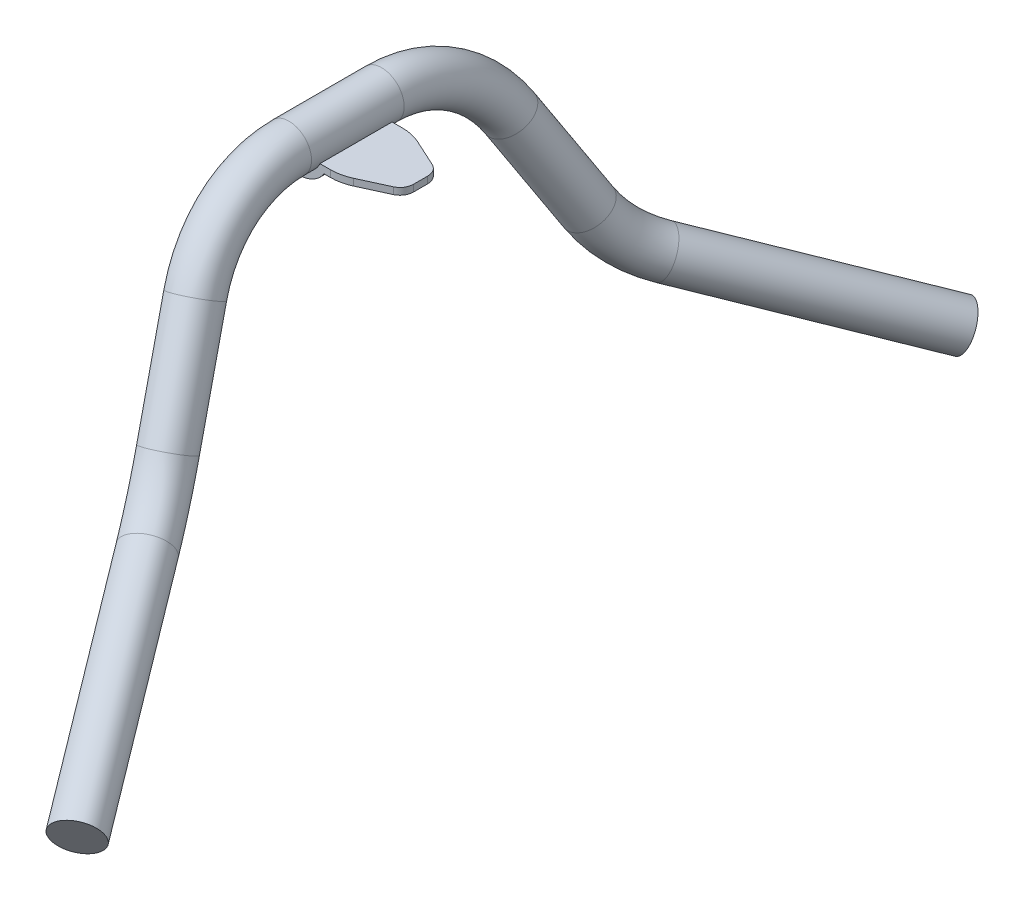
ISO-10303-21;
HEADER;
FILE_DESCRIPTION(('STEP AP214'),'2;1');
FILE_NAME('part.step','',(''),(''),'','','');
FILE_SCHEMA(('AUTOMOTIVE_DESIGN { 1 0 10303 214 1 1 1 1 }'));
ENDSEC;
DATA;
#1=APPLICATION_CONTEXT('core data for automotive mechanical design processes');
#2=APPLICATION_PROTOCOL_DEFINITION('international standard','automotive_design',2000,#1);
#3=PRODUCT_CONTEXT('',#1,'mechanical');
#4=PRODUCT('Part','Part','',(#3));
#5=PRODUCT_RELATED_PRODUCT_CATEGORY('part','',(#4));
#6=PRODUCT_DEFINITION_FORMATION('','',#4);
#7=PRODUCT_DEFINITION_CONTEXT('part definition',#1,'design');
#8=PRODUCT_DEFINITION('design','',#6,#7);
#9=PRODUCT_DEFINITION_SHAPE('','',#8);
#10=(LENGTH_UNIT() NAMED_UNIT(*) SI_UNIT(.MILLI.,.METRE.));
#11=(NAMED_UNIT(*) PLANE_ANGLE_UNIT() SI_UNIT($,.RADIAN.));
#12=(NAMED_UNIT(*) SI_UNIT($,.STERADIAN.) SOLID_ANGLE_UNIT());
#13=UNCERTAINTY_MEASURE_WITH_UNIT(LENGTH_MEASURE(1.E-05),#10,'distance_accuracy_value','');
#14=(GEOMETRIC_REPRESENTATION_CONTEXT(3) GLOBAL_UNCERTAINTY_ASSIGNED_CONTEXT((#13)) GLOBAL_UNIT_ASSIGNED_CONTEXT((#10,
#11,#12)) REPRESENTATION_CONTEXT('',''));
#15=CARTESIAN_POINT('',(0.,0.,0.));
#16=DIRECTION('',(0.,0.,1.));
#17=DIRECTION('',(1.,0.,0.));
#18=AXIS2_PLACEMENT_3D('',#15,#16,#17);
#19=CARTESIAN_POINT('',(-28.448,10.16,13.97));
#20=DIRECTION('',(0.,-1.,0.));
#21=DIRECTION('',(0.,0.,-1.));
#22=AXIS2_PLACEMENT_3D('',#19,#20,#21);
#23=CYLINDRICAL_SURFACE('',#22,6.35);
#24=CARTESIAN_POINT('',(-28.448,6.35,13.97));
#25=DIRECTION('',(0.,-1.,0.));
#26=DIRECTION('',(0.,0.,-1.));
#27=AXIS2_PLACEMENT_3D('',#24,#25,#26);
#28=CIRCLE('',#27,6.35);
#29=CARTESIAN_POINT('',(-28.448,6.35,20.32));
#30=VERTEX_POINT('',#29);
#31=CARTESIAN_POINT('',(-34.798,6.35,13.97));
#32=VERTEX_POINT('',#31);
#33=EDGE_CURVE('E53',#30,#32,#28,.T.);
#34=ORIENTED_EDGE('',*,*,#33,.F.);
#35=DIRECTION('',(0.,-1.,0.));
#36=VECTOR('',#35,1.);
#37=CARTESIAN_POINT('',(-28.448,10.16,20.32));
#38=LINE('',#37,#36);
#39=CARTESIAN_POINT('',(-28.448,10.16,20.32));
#40=VERTEX_POINT('',#39);
#41=EDGE_CURVE('E12',#40,#30,#38,.T.);
#42=ORIENTED_EDGE('',*,*,#41,.F.);
#43=CARTESIAN_POINT('',(-28.448,10.16,13.97));
#44=DIRECTION('',(0.,1.,0.));
#45=DIRECTION('',(0.,0.,1.));
#46=AXIS2_PLACEMENT_3D('',#43,#44,#45);
#47=CIRCLE('',#46,6.35);
#48=CARTESIAN_POINT('',(-34.798,10.16,13.97));
#49=VERTEX_POINT('',#48);
#50=EDGE_CURVE('E265',#49,#40,#47,.T.);
#51=ORIENTED_EDGE('',*,*,#50,.F.);
#52=DIRECTION('',(0.,-1.,0.));
#53=VECTOR('',#52,1.);
#54=CARTESIAN_POINT('',(-34.798,10.16,13.97));
#55=LINE('',#54,#53);
#56=EDGE_CURVE('E187',#49,#32,#55,.T.);
#57=ORIENTED_EDGE('',*,*,#56,.T.);
#58=EDGE_LOOP('',(#34,#42,#51,#57));
#59=FACE_BOUND('',#58,.T.);
#60=ADVANCED_FACE('F39',(#59),#23,.T.);
#61=CARTESIAN_POINT('',(-28.448,10.16,20.32));
#62=DIRECTION('',(0.,0.,-1.));
#63=DIRECTION('',(-1.,0.,0.));
#64=AXIS2_PLACEMENT_3D('',#61,#62,#63);
#65=PLANE('',#64);
#66=CARTESIAN_POINT('',(-12.9982577348122,15.24,20.32));
#67=DIRECTION('',(0.,0.,-1.));
#68=DIRECTION('',(1.,0.,0.));
#69=AXIS2_PLACEMENT_3D('',#66,#67,#68);
#70=CIRCLE('',#69,12.7);
#71=CARTESIAN_POINT('',(-1.35851546962433,10.16,20.32));
#72=VERTEX_POINT('',#71);
#73=CARTESIAN_POINT('',(-24.638,10.16,20.32));
#74=VERTEX_POINT('',#73);
#75=EDGE_CURVE('E159',#72,#74,#70,.T.);
#76=ORIENTED_EDGE('',*,*,#75,.T.);
#77=DIRECTION('',(1.,0.,0.));
#78=VECTOR('',#77,1.);
#79=CARTESIAN_POINT('',(-28.448,10.16,20.32));
#80=LINE('',#79,#78);
#81=EDGE_CURVE('E267',#40,#74,#80,.T.);
#82=ORIENTED_EDGE('',*,*,#81,.F.);
#83=ORIENTED_EDGE('',*,*,#41,.T.);
#84=DIRECTION('',(1.,0.,0.));
#85=VECTOR('',#84,1.);
#86=CARTESIAN_POINT('',(-34.798,6.35,20.32));
#87=LINE('',#86,#85);
#88=CARTESIAN_POINT('',(-26.9104106954434,6.35,20.32));
#89=VERTEX_POINT('',#88);
#90=EDGE_CURVE('E238',#30,#89,#87,.T.);
#91=ORIENTED_EDGE('',*,*,#90,.T.);
#92=CARTESIAN_POINT('',(-12.9982577348122,15.24,20.32));
#93=DIRECTION('',(0.,0.,1.));
#94=DIRECTION('',(1.,0.,0.));
#95=AXIS2_PLACEMENT_3D('',#92,#93,#94);
#96=CIRCLE('',#95,16.51);
#97=CARTESIAN_POINT('',(0.913895225819061,6.35,20.32));
#98=VERTEX_POINT('',#97);
#99=EDGE_CURVE('E233',#89,#98,#96,.T.);
#100=ORIENTED_EDGE('',*,*,#99,.T.);
#101=DIRECTION('',(1.,0.,0.));
#102=VECTOR('',#101,1.);
#103=CARTESIAN_POINT('',(35.052,6.35,20.32));
#104=LINE('',#103,#102);
#105=CARTESIAN_POINT('',(4.60708517540099,6.35,20.32));
#106=VERTEX_POINT('',#105);
#107=EDGE_CURVE('E230',#98,#106,#104,.T.);
#108=ORIENTED_EDGE('',*,*,#107,.T.);
#109=DIRECTION('',(0.,-1.,0.));
#110=VECTOR('',#109,1.);
#111=CARTESIAN_POINT('',(4.6070851754009,10.16,20.32));
#112=LINE('',#111,#110);
#113=CARTESIAN_POINT('',(4.6070851754009,10.16,20.32));
#114=VERTEX_POINT('',#113);
#115=EDGE_CURVE('E46',#114,#106,#112,.T.);
#116=ORIENTED_EDGE('',*,*,#115,.F.);
#117=EDGE_CURVE('E227',#72,#114,#80,.T.);
#118=ORIENTED_EDGE('',*,*,#117,.F.);
#119=EDGE_LOOP('',(#76,#82,#83,#91,#100,#108,#116,#118));
#120=FACE_BOUND('',#119,.T.);
#121=ADVANCED_FACE('F226',(#120),#65,.F.);
#122=CARTESIAN_POINT('',(4.60708517540099,10.16,-5.07999999999999));
#123=DIRECTION('',(0.,-1.,0.));
#124=DIRECTION('',(0.,0.,-1.));
#125=AXIS2_PLACEMENT_3D('',#122,#123,#124);
#126=CYLINDRICAL_SURFACE('',#125,25.4);
#127=CARTESIAN_POINT('',(4.60708517540099,6.35,-5.07999999999999));
#128=DIRECTION('',(0.,-1.,0.));
#129=DIRECTION('',(0.,0.,-1.));
#130=AXIS2_PLACEMENT_3D('',#127,#128,#129);
#131=CIRCLE('',#130,25.4);
#132=CARTESIAN_POINT('',(15.206332962813,6.35,18.0028062925859));
#133=VERTEX_POINT('',#132);
#134=EDGE_CURVE('E222',#133,#106,#131,.T.);
#135=ORIENTED_EDGE('',*,*,#134,.F.);
#136=DIRECTION('',(0.,-1.,0.));
#137=VECTOR('',#136,1.);
#138=CARTESIAN_POINT('',(15.206332962813,10.16,18.0028062925859));
#139=LINE('',#138,#137);
#140=CARTESIAN_POINT('',(15.206332962813,10.16,18.0028062925859));
#141=VERTEX_POINT('',#140);
#142=EDGE_CURVE('E213',#141,#133,#139,.T.);
#143=ORIENTED_EDGE('',*,*,#142,.F.);
#144=CARTESIAN_POINT('',(4.60708517540099,10.16,-5.07999999999999));
#145=DIRECTION('',(0.,1.,0.));
#146=DIRECTION('',(0.,0.,1.));
#147=AXIS2_PLACEMENT_3D('',#144,#145,#146);
#148=CIRCLE('',#147,25.4);
#149=EDGE_CURVE('E223',#114,#141,#148,.T.);
#150=ORIENTED_EDGE('',*,*,#149,.F.);
#151=ORIENTED_EDGE('',*,*,#115,.T.);
#152=EDGE_LOOP('',(#135,#143,#150,#151));
#153=FACE_BOUND('',#152,.T.);
#154=ADVANCED_FACE('F220',(#153),#126,.T.);
#155=CARTESIAN_POINT('',(15.206332962813,10.16,18.0028062925859));
#156=DIRECTION('',(-0.417293219976847,0.,-0.90877190128291));
#157=DIRECTION('',(-0.90877190128291,0.,0.417293219976847));
#158=AXIS2_PLACEMENT_3D('',#155,#156,#157);
#159=PLANE('',#158);
#160=DIRECTION('',(-0.90877190128291,0.,0.417293219976847));
#161=VECTOR('',#160,1.);
#162=CARTESIAN_POINT('',(15.206332962813,6.35,18.0028062925859));
#163=LINE('',#162,#161);
#164=CARTESIAN_POINT('',(30.6117743362235,6.35,10.9288791313259));
#165=VERTEX_POINT('',#164);
#166=EDGE_CURVE('E262',#165,#133,#163,.T.);
#167=ORIENTED_EDGE('',*,*,#166,.F.);
#168=DIRECTION('',(0.,-1.,0.));
#169=VECTOR('',#168,1.);
#170=CARTESIAN_POINT('',(30.6117743362235,10.16,10.9288791313259));
#171=LINE('',#170,#169);
#172=CARTESIAN_POINT('',(30.6117743362235,10.16,10.9288791313259));
#173=VERTEX_POINT('',#172);
#174=EDGE_CURVE('E210',#173,#165,#171,.T.);
#175=ORIENTED_EDGE('',*,*,#174,.F.);
#176=DIRECTION('',(0.90877190128291,0.,-0.417293219976847));
#177=VECTOR('',#176,1.);
#178=CARTESIAN_POINT('',(15.206332962813,10.16,18.0028062925859));
#179=LINE('',#178,#177);
#180=EDGE_CURVE('E271',#141,#173,#179,.T.);
#181=ORIENTED_EDGE('',*,*,#180,.F.);
#182=ORIENTED_EDGE('',*,*,#142,.T.);
#183=EDGE_LOOP('',(#167,#175,#181,#182));
#184=FACE_BOUND('',#183,.T.);
#185=ADVANCED_FACE('F360',(#184),#159,.F.);
#186=CARTESIAN_POINT('',(27.432,10.16,4.00403724355014));
#187=DIRECTION('',(0.,-1.,0.));
#188=DIRECTION('',(0.,0.,-1.));
#189=AXIS2_PLACEMENT_3D('',#186,#187,#188);
#190=CYLINDRICAL_SURFACE('',#189,7.62);
#191=CARTESIAN_POINT('',(27.432,6.35,4.00403724355014));
#192=DIRECTION('',(0.,-1.,0.));
#193=DIRECTION('',(0.,0.,-1.));
#194=AXIS2_PLACEMENT_3D('',#191,#192,#193);
#195=CIRCLE('',#194,7.62);
#196=CARTESIAN_POINT('',(35.052,6.35,4.0040372435501));
#197=VERTEX_POINT('',#196);
#198=EDGE_CURVE('E260',#197,#165,#195,.T.);
#199=ORIENTED_EDGE('',*,*,#198,.F.);
#200=DIRECTION('',(0.,-1.,0.));
#201=VECTOR('',#200,1.);
#202=CARTESIAN_POINT('',(35.052,10.16,4.0040372435501));
#203=LINE('',#202,#201);
#204=CARTESIAN_POINT('',(35.052,10.16,4.0040372435501));
#205=VERTEX_POINT('',#204);
#206=EDGE_CURVE('E207',#205,#197,#203,.T.);
#207=ORIENTED_EDGE('',*,*,#206,.F.);
#208=CARTESIAN_POINT('',(27.432,10.16,4.00403724355014));
#209=DIRECTION('',(0.,1.,0.));
#210=DIRECTION('',(0.,0.,1.));
#211=AXIS2_PLACEMENT_3D('',#208,#209,#210);
#212=CIRCLE('',#211,7.62);
#213=EDGE_CURVE('E273',#173,#205,#212,.T.);
#214=ORIENTED_EDGE('',*,*,#213,.F.);
#215=ORIENTED_EDGE('',*,*,#174,.T.);
#216=EDGE_LOOP('',(#199,#207,#214,#215));
#217=FACE_BOUND('',#216,.T.);
#218=ADVANCED_FACE('F356',(#217),#190,.T.);
#219=CARTESIAN_POINT('',(35.052,10.16,4.0040372435501));
#220=DIRECTION('',(-1.,0.,0.));
#221=DIRECTION('',(0.,0.,1.));
#222=AXIS2_PLACEMENT_3D('',#219,#220,#221);
#223=PLANE('',#222);
#224=DIRECTION('',(0.,0.,1.));
#225=VECTOR('',#224,1.);
#226=CARTESIAN_POINT('',(35.052,6.35,-20.32));
#227=LINE('',#226,#225);
#228=CARTESIAN_POINT('',(35.052,6.35,-4.00403724355014));
#229=VERTEX_POINT('',#228);
#230=EDGE_CURVE('E164',#229,#197,#227,.T.);
#231=ORIENTED_EDGE('',*,*,#230,.F.);
#232=DIRECTION('',(0.,-1.,0.));
#233=VECTOR('',#232,1.);
#234=CARTESIAN_POINT('',(35.052,10.16,-4.0040372435501));
#235=LINE('',#234,#233);
#236=CARTESIAN_POINT('',(35.052,10.16,-4.0040372435501));
#237=VERTEX_POINT('',#236);
#238=EDGE_CURVE('E204',#237,#229,#235,.T.);
#239=ORIENTED_EDGE('',*,*,#238,.F.);
#240=DIRECTION('',(0.,0.,-1.));
#241=VECTOR('',#240,1.);
#242=CARTESIAN_POINT('',(35.052,10.16,4.0040372435501));
#243=LINE('',#242,#241);
#244=EDGE_CURVE('E275',#205,#237,#243,.T.);
#245=ORIENTED_EDGE('',*,*,#244,.F.);
#246=ORIENTED_EDGE('',*,*,#206,.T.);
#247=EDGE_LOOP('',(#231,#239,#245,#246));
#248=FACE_BOUND('',#247,.T.);
#249=ADVANCED_FACE('F352',(#248),#223,.F.);
#250=CARTESIAN_POINT('',(27.432,10.16,-4.00403724355014));
#251=DIRECTION('',(0.,-1.,0.));
#252=DIRECTION('',(0.,0.,-1.));
#253=AXIS2_PLACEMENT_3D('',#250,#251,#252);
#254=CYLINDRICAL_SURFACE('',#253,7.62);
#255=CARTESIAN_POINT('',(27.432,6.35,-4.00403724355014));
#256=DIRECTION('',(0.,-1.,0.));
#257=DIRECTION('',(0.,0.,-1.));
#258=AXIS2_PLACEMENT_3D('',#255,#256,#257);
#259=CIRCLE('',#258,7.62);
#260=CARTESIAN_POINT('',(30.6117743362235,6.35,-10.9288791313259));
#261=VERTEX_POINT('',#260);
#262=EDGE_CURVE('E258',#261,#229,#259,.T.);
#263=ORIENTED_EDGE('',*,*,#262,.F.);
#264=DIRECTION('',(0.,-1.,0.));
#265=VECTOR('',#264,1.);
#266=CARTESIAN_POINT('',(30.6117743362235,10.16,-10.9288791313259));
#267=LINE('',#266,#265);
#268=CARTESIAN_POINT('',(30.6117743362235,10.16,-10.9288791313259));
#269=VERTEX_POINT('',#268);
#270=EDGE_CURVE('E201',#269,#261,#267,.T.);
#271=ORIENTED_EDGE('',*,*,#270,.F.);
#272=CARTESIAN_POINT('',(27.432,10.16,-4.00403724355014));
#273=DIRECTION('',(0.,1.,0.));
#274=DIRECTION('',(0.,0.,1.));
#275=AXIS2_PLACEMENT_3D('',#272,#273,#274);
#276=CIRCLE('',#275,7.62);
#277=EDGE_CURVE('E277',#237,#269,#276,.T.);
#278=ORIENTED_EDGE('',*,*,#277,.F.);
#279=ORIENTED_EDGE('',*,*,#238,.T.);
#280=EDGE_LOOP('',(#263,#271,#278,#279));
#281=FACE_BOUND('',#280,.T.);
#282=ADVANCED_FACE('F349',(#281),#254,.T.);
#283=CARTESIAN_POINT('',(30.6117743362235,10.16,-10.9288791313259));
#284=DIRECTION('',(-0.417293219976847,0.,0.90877190128291));
#285=DIRECTION('',(0.90877190128291,0.,0.417293219976847));
#286=AXIS2_PLACEMENT_3D('',#283,#284,#285);
#287=PLANE('',#286);
#288=DIRECTION('',(0.90877190128291,0.,0.417293219976847));
#289=VECTOR('',#288,1.);
#290=CARTESIAN_POINT('',(30.6117743362235,6.35,-10.9288791313259));
#291=LINE('',#290,#289);
#292=CARTESIAN_POINT('',(15.206332962813,6.35,-18.0028062925859));
#293=VERTEX_POINT('',#292);
#294=EDGE_CURVE('E256',#293,#261,#291,.T.);
#295=ORIENTED_EDGE('',*,*,#294,.F.);
#296=DIRECTION('',(0.,-1.,0.));
#297=VECTOR('',#296,1.);
#298=CARTESIAN_POINT('',(15.206332962813,10.16,-18.0028062925859));
#299=LINE('',#298,#297);
#300=CARTESIAN_POINT('',(15.206332962813,10.16,-18.0028062925859));
#301=VERTEX_POINT('',#300);
#302=EDGE_CURVE('E198',#301,#293,#299,.T.);
#303=ORIENTED_EDGE('',*,*,#302,.F.);
#304=DIRECTION('',(-0.90877190128291,0.,-0.417293219976847));
#305=VECTOR('',#304,1.);
#306=CARTESIAN_POINT('',(30.6117743362235,10.16,-10.9288791313259));
#307=LINE('',#306,#305);
#308=EDGE_CURVE('E278',#269,#301,#307,.T.);
#309=ORIENTED_EDGE('',*,*,#308,.F.);
#310=ORIENTED_EDGE('',*,*,#270,.T.);
#311=EDGE_LOOP('',(#295,#303,#309,#310));
#312=FACE_BOUND('',#311,.T.);
#313=ADVANCED_FACE('F285',(#312),#287,.F.);
#314=CARTESIAN_POINT('',(4.60708517540099,10.16,5.07999999999999));
#315=DIRECTION('',(0.,-1.,0.));
#316=DIRECTION('',(0.,0.,-1.));
#317=AXIS2_PLACEMENT_3D('',#314,#315,#316);
#318=CYLINDRICAL_SURFACE('',#317,25.4);
#319=CARTESIAN_POINT('',(4.60708517540099,6.35,5.07999999999999));
#320=DIRECTION('',(0.,-1.,0.));
#321=DIRECTION('',(0.,0.,-1.));
#322=AXIS2_PLACEMENT_3D('',#319,#320,#321);
#323=CIRCLE('',#322,25.4);
#324=CARTESIAN_POINT('',(4.6070851754009,6.35,-20.32));
#325=VERTEX_POINT('',#324);
#326=EDGE_CURVE('E254',#325,#293,#323,.T.);
#327=ORIENTED_EDGE('',*,*,#326,.F.);
#328=DIRECTION('',(0.,-1.,0.));
#329=VECTOR('',#328,1.);
#330=CARTESIAN_POINT('',(4.6070851754009,10.16,-20.32));
#331=LINE('',#330,#329);
#332=CARTESIAN_POINT('',(4.6070851754009,10.16,-20.32));
#333=VERTEX_POINT('',#332);
#334=EDGE_CURVE('E196',#333,#325,#331,.T.);
#335=ORIENTED_EDGE('',*,*,#334,.F.);
#336=CARTESIAN_POINT('',(4.60708517540099,10.16,5.07999999999999));
#337=DIRECTION('',(0.,1.,0.));
#338=DIRECTION('',(0.,0.,-1.));
#339=AXIS2_PLACEMENT_3D('',#336,#337,#338);
#340=CIRCLE('',#339,25.4);
#341=EDGE_CURVE('E178',#301,#333,#340,.T.);
#342=ORIENTED_EDGE('',*,*,#341,.F.);
#343=ORIENTED_EDGE('',*,*,#302,.T.);
#344=EDGE_LOOP('',(#327,#335,#342,#343));
#345=FACE_BOUND('',#344,.T.);
#346=ADVANCED_FACE('F288',(#345),#318,.T.);
#347=CARTESIAN_POINT('',(4.6070851754009,10.16,-20.32));
#348=DIRECTION('',(0.,0.,1.));
#349=DIRECTION('',(1.,0.,0.));
#350=AXIS2_PLACEMENT_3D('',#347,#348,#349);
#351=PLANE('',#350);
#352=CARTESIAN_POINT('',(-12.9982577348122,15.24,-20.32));
#353=DIRECTION('',(0.,0.,-1.));
#354=DIRECTION('',(1.,0.,0.));
#355=AXIS2_PLACEMENT_3D('',#352,#353,#354);
#356=CIRCLE('',#355,12.7);
#357=CARTESIAN_POINT('',(-1.35851546962433,10.16,-20.32));
#358=VERTEX_POINT('',#357);
#359=CARTESIAN_POINT('',(-24.638,10.16,-20.32));
#360=VERTEX_POINT('',#359);
#361=EDGE_CURVE('E156',#358,#360,#356,.T.);
#362=ORIENTED_EDGE('',*,*,#361,.F.);
#363=DIRECTION('',(-1.,0.,0.));
#364=VECTOR('',#363,1.);
#365=CARTESIAN_POINT('',(4.6070851754009,10.16,-20.32));
#366=LINE('',#365,#364);
#367=EDGE_CURVE('E170',#333,#358,#366,.T.);
#368=ORIENTED_EDGE('',*,*,#367,.F.);
#369=ORIENTED_EDGE('',*,*,#334,.T.);
#370=DIRECTION('',(1.,0.,0.));
#371=VECTOR('',#370,1.);
#372=CARTESIAN_POINT('',(35.052,6.35,-20.32));
#373=LINE('',#372,#371);
#374=CARTESIAN_POINT('',(0.913895225819061,6.35,-20.32));
#375=VERTEX_POINT('',#374);
#376=EDGE_CURVE('E251',#375,#325,#373,.T.);
#377=ORIENTED_EDGE('',*,*,#376,.F.);
#378=CARTESIAN_POINT('',(-12.9982577348122,15.24,-20.32));
#379=DIRECTION('',(0.,0.,1.));
#380=DIRECTION('',(1.,0.,0.));
#381=AXIS2_PLACEMENT_3D('',#378,#379,#380);
#382=CIRCLE('',#381,16.51);
#383=CARTESIAN_POINT('',(-26.9104106954434,6.35,-20.32));
#384=VERTEX_POINT('',#383);
#385=EDGE_CURVE('E293',#384,#375,#382,.T.);
#386=ORIENTED_EDGE('',*,*,#385,.F.);
#387=DIRECTION('',(1.,0.,0.));
#388=VECTOR('',#387,1.);
#389=CARTESIAN_POINT('',(-34.798,6.35,-20.32));
#390=LINE('',#389,#388);
#391=CARTESIAN_POINT('',(-28.448,6.35,-20.32));
#392=VERTEX_POINT('',#391);
#393=EDGE_CURVE('E236',#392,#384,#390,.T.);
#394=ORIENTED_EDGE('',*,*,#393,.F.);
#395=DIRECTION('',(0.,-1.,0.));
#396=VECTOR('',#395,1.);
#397=CARTESIAN_POINT('',(-28.448,10.16,-20.32));
#398=LINE('',#397,#396);
#399=CARTESIAN_POINT('',(-28.448,10.16,-20.32));
#400=VERTEX_POINT('',#399);
#401=EDGE_CURVE('E193',#400,#392,#398,.T.);
#402=ORIENTED_EDGE('',*,*,#401,.F.);
#403=EDGE_CURVE('E172',#360,#400,#366,.T.);
#404=ORIENTED_EDGE('',*,*,#403,.F.);
#405=EDGE_LOOP('',(#362,#368,#369,#377,#386,#394,#402,#404));
#406=FACE_BOUND('',#405,.T.);
#407=ADVANCED_FACE('F168',(#406),#351,.F.);
#408=CARTESIAN_POINT('',(-28.448,10.16,-13.97));
#409=DIRECTION('',(0.,-1.,0.));
#410=DIRECTION('',(0.,0.,-1.));
#411=AXIS2_PLACEMENT_3D('',#408,#409,#410);
#412=CYLINDRICAL_SURFACE('',#411,6.35);
#413=CARTESIAN_POINT('',(-28.448,6.35,-13.97));
#414=DIRECTION('',(0.,-1.,0.));
#415=DIRECTION('',(0.,0.,-1.));
#416=AXIS2_PLACEMENT_3D('',#413,#414,#415);
#417=CIRCLE('',#416,6.35);
#418=CARTESIAN_POINT('',(-34.798,6.35,-13.97));
#419=VERTEX_POINT('',#418);
#420=EDGE_CURVE('E242',#419,#392,#417,.T.);
#421=ORIENTED_EDGE('',*,*,#420,.F.);
#422=DIRECTION('',(0.,-1.,0.));
#423=VECTOR('',#422,1.);
#424=CARTESIAN_POINT('',(-34.798,10.16,-13.97));
#425=LINE('',#424,#423);
#426=CARTESIAN_POINT('',(-34.798,10.16,-13.97));
#427=VERTEX_POINT('',#426);
#428=EDGE_CURVE('E190',#427,#419,#425,.T.);
#429=ORIENTED_EDGE('',*,*,#428,.F.);
#430=CARTESIAN_POINT('',(-28.448,10.16,-13.97));
#431=DIRECTION('',(0.,1.,0.));
#432=DIRECTION('',(0.,0.,1.));
#433=AXIS2_PLACEMENT_3D('',#430,#431,#432);
#434=CIRCLE('',#433,6.35);
#435=EDGE_CURVE('E180',#400,#427,#434,.T.);
#436=ORIENTED_EDGE('',*,*,#435,.F.);
#437=ORIENTED_EDGE('',*,*,#401,.T.);
#438=EDGE_LOOP('',(#421,#429,#436,#437));
#439=FACE_BOUND('',#438,.T.);
#440=ADVANCED_FACE('F336',(#439),#412,.T.);
#441=CARTESIAN_POINT('',(-34.798,10.16,-13.97));
#442=DIRECTION('',(1.,0.,0.));
#443=DIRECTION('',(0.,0.,-1.));
#444=AXIS2_PLACEMENT_3D('',#441,#442,#443);
#445=PLANE('',#444);
#446=DIRECTION('',(0.,0.,1.));
#447=VECTOR('',#446,1.);
#448=CARTESIAN_POINT('',(-34.798,6.35,-20.32));
#449=LINE('',#448,#447);
#450=EDGE_CURVE('E249',#419,#32,#449,.T.);
#451=ORIENTED_EDGE('',*,*,#450,.T.);
#452=ORIENTED_EDGE('',*,*,#56,.F.);
#453=DIRECTION('',(0.,0.,1.));
#454=VECTOR('',#453,1.);
#455=CARTESIAN_POINT('',(-34.798,10.16,-13.97));
#456=LINE('',#455,#454);
#457=EDGE_CURVE('E61',#427,#49,#456,.T.);
#458=ORIENTED_EDGE('',*,*,#457,.F.);
#459=ORIENTED_EDGE('',*,*,#428,.T.);
#460=EDGE_LOOP('',(#451,#452,#458,#459));
#461=FACE_BOUND('',#460,.T.);
#462=ADVANCED_FACE('F332',(#461),#445,.F.);
#463=CARTESIAN_POINT('',(-28.448,10.16,13.97));
#464=DIRECTION('',(0.,1.,0.));
#465=DIRECTION('',(0.,0.,1.));
#466=AXIS2_PLACEMENT_3D('',#463,#464,#465);
#467=PLANE('',#466);
#468=ORIENTED_EDGE('',*,*,#81,.T.);
#469=DIRECTION('',(0.,0.,1.));
#470=VECTOR('',#469,1.);
#471=CARTESIAN_POINT('',(-24.638,10.16,-20.32));
#472=LINE('',#471,#470);
#473=EDGE_CURVE('E163',#360,#74,#472,.T.);
#474=ORIENTED_EDGE('',*,*,#473,.F.);
#475=ORIENTED_EDGE('',*,*,#403,.T.);
#476=ORIENTED_EDGE('',*,*,#435,.T.);
#477=ORIENTED_EDGE('',*,*,#457,.T.);
#478=ORIENTED_EDGE('',*,*,#50,.T.);
#479=EDGE_LOOP('',(#468,#474,#475,#476,#477,#478));
#480=FACE_BOUND('',#479,.T.);
#481=ADVANCED_FACE('F320',(#480),#467,.T.);
#482=ORIENTED_EDGE('',*,*,#367,.T.);
#483=DIRECTION('',(0.,0.,1.));
#484=VECTOR('',#483,1.);
#485=CARTESIAN_POINT('',(-1.35851546962433,10.16,-20.32));
#486=LINE('',#485,#484);
#487=EDGE_CURVE('E152',#358,#72,#486,.T.);
#488=ORIENTED_EDGE('',*,*,#487,.T.);
#489=ORIENTED_EDGE('',*,*,#117,.T.);
#490=ORIENTED_EDGE('',*,*,#149,.T.);
#491=ORIENTED_EDGE('',*,*,#180,.T.);
#492=ORIENTED_EDGE('',*,*,#213,.T.);
#493=ORIENTED_EDGE('',*,*,#244,.T.);
#494=ORIENTED_EDGE('',*,*,#277,.T.);
#495=ORIENTED_EDGE('',*,*,#308,.T.);
#496=ORIENTED_EDGE('',*,*,#341,.T.);
#497=EDGE_LOOP('',(#482,#488,#489,#490,#491,#492,#493,#494,#495,#496));
#498=FACE_BOUND('',#497,.T.);
#499=ADVANCED_FACE('F176',(#498),#467,.T.);
#500=CARTESIAN_POINT('',(35.052,6.35,-20.32));
#501=DIRECTION('',(0.,-1.,0.));
#502=DIRECTION('',(0.,0.,-1.));
#503=AXIS2_PLACEMENT_3D('',#500,#501,#502);
#504=PLANE('',#503);
#505=ORIENTED_EDGE('',*,*,#134,.T.);
#506=ORIENTED_EDGE('',*,*,#107,.F.);
#507=DIRECTION('',(0.,0.,1.));
#508=VECTOR('',#507,1.);
#509=CARTESIAN_POINT('',(0.913895225819061,6.35,-20.32));
#510=LINE('',#509,#508);
#511=EDGE_CURVE('E245',#375,#98,#510,.T.);
#512=ORIENTED_EDGE('',*,*,#511,.F.);
#513=ORIENTED_EDGE('',*,*,#376,.T.);
#514=ORIENTED_EDGE('',*,*,#326,.T.);
#515=ORIENTED_EDGE('',*,*,#294,.T.);
#516=ORIENTED_EDGE('',*,*,#262,.T.);
#517=ORIENTED_EDGE('',*,*,#230,.T.);
#518=ORIENTED_EDGE('',*,*,#198,.T.);
#519=ORIENTED_EDGE('',*,*,#166,.T.);
#520=EDGE_LOOP('',(#505,#506,#512,#513,#514,#515,#516,#517,#518,#519));
#521=FACE_BOUND('',#520,.T.);
#522=ADVANCED_FACE('F312',(#521),#504,.T.);
#523=CARTESIAN_POINT('',(-34.798,6.35,-20.32));
#524=DIRECTION('',(0.,-1.,0.));
#525=DIRECTION('',(0.,0.,-1.));
#526=AXIS2_PLACEMENT_3D('',#523,#524,#525);
#527=PLANE('',#526);
#528=ORIENTED_EDGE('',*,*,#33,.T.);
#529=ORIENTED_EDGE('',*,*,#450,.F.);
#530=ORIENTED_EDGE('',*,*,#420,.T.);
#531=ORIENTED_EDGE('',*,*,#393,.T.);
#532=DIRECTION('',(0.,0.,1.));
#533=VECTOR('',#532,1.);
#534=CARTESIAN_POINT('',(-26.9104106954434,6.35,-20.32));
#535=LINE('',#534,#533);
#536=EDGE_CURVE('E247',#384,#89,#535,.T.);
#537=ORIENTED_EDGE('',*,*,#536,.T.);
#538=ORIENTED_EDGE('',*,*,#90,.F.);
#539=EDGE_LOOP('',(#528,#529,#530,#531,#537,#538));
#540=FACE_BOUND('',#539,.T.);
#541=ADVANCED_FACE('F308',(#540),#527,.T.);
#542=CARTESIAN_POINT('',(-12.9982577348122,15.24,-20.32));
#543=DIRECTION('',(0.,0.,1.));
#544=DIRECTION('',(1.,0.,0.));
#545=AXIS2_PLACEMENT_3D('',#542,#543,#544);
#546=CYLINDRICAL_SURFACE('',#545,16.51);
#547=ORIENTED_EDGE('',*,*,#99,.F.);
#548=ORIENTED_EDGE('',*,*,#536,.F.);
#549=ORIENTED_EDGE('',*,*,#385,.T.);
#550=ORIENTED_EDGE('',*,*,#511,.T.);
#551=EDGE_LOOP('',(#547,#548,#549,#550));
#552=FACE_BOUND('',#551,.T.);
#553=ADVANCED_FACE('F311',(#552),#546,.T.);
#554=CARTESIAN_POINT('',(91.1417422651878,-157.48,249.564780828328));
#555=DIRECTION('',(0.479674796747967,-0.414634146341463,0.773298528417378));
#556=DIRECTION('',(0.875032293842701,0.291373953989815,-0.386548449316154));
#557=AXIS2_PLACEMENT_3D('',#554,#555,#556);
#558=PLANE('',#557);
#559=CARTESIAN_POINT('',(91.1417422651878,-157.48,249.564780828328));
#560=DIRECTION('',(0.479674796747967,-0.414634146341463,0.773298528417378));
#561=DIRECTION('',(0.875032293842701,0.291373953989815,-0.386548449316154));
#562=AXIS2_PLACEMENT_3D('',#559,#560,#561);
#563=CIRCLE('',#562,12.7);
#564=CARTESIAN_POINT('',(102.25465239699,-153.779550784329,244.655615522013));
#565=VERTEX_POINT('',#564);
#566=EDGE_CURVE('E297',#565,#565,#563,.T.);
#567=ORIENTED_EDGE('',*,*,#566,.T.);
#568=EDGE_LOOP('',(#567));
#569=FACE_BOUND('',#568,.T.);
#570=ADVANCED_FACE('F439',(#569),#558,.T.);
#571=CARTESIAN_POINT('',(-12.9982577348122,15.24,0.));
#572=DIRECTION('',(0.,0.,1.));
#573=DIRECTION('',(1.,0.,0.));
#574=AXIS2_PLACEMENT_3D('',#571,#572,#573);
#575=CYLINDRICAL_SURFACE('',#574,12.7);
#576=CARTESIAN_POINT('',(-12.9982577348122,15.24,26.0905816371625));
#577=DIRECTION('',(0.,0.,1.));
#578=DIRECTION('',(1.,0.,0.));
#579=AXIS2_PLACEMENT_3D('',#576,#577,#578);
#580=CIRCLE('',#579,12.7);
#581=CARTESIAN_POINT('',(-16.3154348352092,27.4991327623369,26.0905816371625));
#582=VERTEX_POINT('',#581);
#583=EDGE_CURVE('E173',#582,#582,#580,.T.);
#584=ORIENTED_EDGE('',*,*,#583,.F.);
#585=EDGE_LOOP('',(#584));
#586=FACE_BOUND('',#585,.T.);
#587=ORIENTED_EDGE('',*,*,#487,.F.);
#588=ORIENTED_EDGE('',*,*,#361,.T.);
#589=ORIENTED_EDGE('',*,*,#473,.T.);
#590=ORIENTED_EDGE('',*,*,#75,.F.);
#591=EDGE_LOOP('',(#587,#588,#589,#590));
#592=FACE_BOUND('',#591,.T.);
#593=CARTESIAN_POINT('',(-12.9982577348122,15.24,-26.0905816371625));
#594=DIRECTION('',(0.,0.,1.));
#595=DIRECTION('',(1.,0.,0.));
#596=AXIS2_PLACEMENT_3D('',#593,#594,#595);
#597=CIRCLE('',#596,12.7);
#598=CARTESIAN_POINT('',(-16.3154348352092,27.4991327623369,-26.0905816371625));
#599=VERTEX_POINT('',#598);
#600=EDGE_CURVE('E617',#599,#599,#597,.T.);
#601=ORIENTED_EDGE('',*,*,#600,.T.);
#602=EDGE_LOOP('',(#601));
#603=FACE_BOUND('',#602,.T.);
#604=ADVANCED_FACE('F154',(#586,#592,#603),#575,.T.);
#605=CARTESIAN_POINT('',(5.57793402741127,-53.4111434690865,26.0905816371625));
#606=DIRECTION('',(0.965286044278495,0.261195047275358,0.));
#607=DIRECTION('',(-0.261195047275358,0.965286044278495,0.));
#608=AXIS2_PLACEMENT_3D('',#605,#606,#607);
#609=TOROIDAL_SURFACE('',#608,71.12,12.7);
#610=CARTESIAN_POINT('',(-3.22569151135953,-20.8760056084119,88.7165776911974));
#611=DIRECTION('',(0.23,-0.85,0.473919824442912));
#612=DIRECTION('',(0.964109309663438,0.132639507765554,-0.23));
#613=AXIS2_PLACEMENT_3D('',#610,#611,#612);
#614=CIRCLE('',#613,12.7);
#615=CARTESIAN_POINT('',(-4.79776750042574,-15.0661595618628,99.8997912722751));
#616=VERTEX_POINT('',#615);
#617=EDGE_CURVE('E600',#616,#616,#614,.T.);
#618=CARTESIAN_POINT('',(5.57793402741127,-53.4111434690865,26.0905816371625));
#619=DIRECTION('',(0.965286044278495,0.261195047275358,0.));
#620=DIRECTION('',(-0.261195047275358,0.965286044278495,0.));
#621=AXIS2_PLACEMENT_3D('',#618,#619,#620);
#622=CIRCLE('',#621,83.82);
#623=EDGE_CURVE('',#582,#616,#622,.T.);
#624=ORIENTED_EDGE('',*,*,#583,.T.);
#625=ORIENTED_EDGE('',*,*,#617,.F.);
#626=ORIENTED_EDGE('',*,*,#623,.T.);
#627=ORIENTED_EDGE('',*,*,#623,.F.);
#628=EDGE_LOOP('',(#624,#626,#625,#627));
#629=FACE_BOUND('',#628,.T.);
#630=ADVANCED_FACE('F463',(#629),#609,.T.);
#631=CARTESIAN_POINT('',(-3.22569151135953,-20.8760056084119,88.7165776911974));
#632=DIRECTION('',(0.23,-0.85,0.473919824442911));
#633=DIRECTION('',(0.,-0.486975326738723,-0.87341572641424));
#634=AXIS2_PLACEMENT_3D('',#631,#632,#633);
#635=CYLINDRICAL_SURFACE('',#634,12.7);
#636=CARTESIAN_POINT('',(11.2140519105981,-74.240274776516,118.469971897871));
#637=DIRECTION('',(0.23,-0.85,0.473919824442911));
#638=DIRECTION('',(0.964109309663438,0.132639507765554,-0.23));
#639=AXIS2_PLACEMENT_3D('',#636,#637,#638);
#640=CIRCLE('',#639,12.7);
#641=CARTESIAN_POINT('',(4.64803462249985,-80.8352978277174,109.828034156454));
#642=VERTEX_POINT('',#641);
#643=EDGE_CURVE('E304',#642,#642,#640,.T.);
#644=ORIENTED_EDGE('',*,*,#643,.F.);
#645=EDGE_LOOP('',(#644));
#646=FACE_BOUND('',#645,.T.);
#647=ORIENTED_EDGE('',*,*,#617,.T.);
#648=EDGE_LOOP('',(#647));
#649=FACE_BOUND('',#648,.T.);
#650=ADVANCED_FACE('F469',(#646,#649),#635,.T.);
#651=CARTESIAN_POINT('',(47.9837487239481,-37.3081456897879,166.864823249802));
#652=DIRECTION('',(-0.824500728096557,0.0885133921211703,0.558895275327544));
#653=DIRECTION('',(0.561097590753353,0.,0.8277496563882));
#654=AXIS2_PLACEMENT_3D('',#651,#652,#653);
#655=TOROIDAL_SURFACE('',#654,71.12,12.7);
#656=CARTESIAN_POINT('',(26.6346383740884,-101.719622060236,145.570889863772));
#657=DIRECTION('',(0.479674796747967,-0.414634146341463,0.773298528417378));
#658=DIRECTION('',(0.875032293842701,0.291373953989815,-0.386548449316153));
#659=AXIS2_PLACEMENT_3D('',#656,#657,#658);
#660=CIRCLE('',#659,12.7);
#661=CARTESIAN_POINT('',(22.8222972401849,-113.221671412102,141.768401759123));
#662=VERTEX_POINT('',#661);
#663=EDGE_CURVE('E299',#662,#662,#660,.T.);
#664=CARTESIAN_POINT('',(47.9837487239481,-37.3081456897879,166.864823249802));
#665=DIRECTION('',(-0.824500728096557,0.0885133921211703,0.558895275327544));
#666=DIRECTION('',(0.561097590753353,0.,0.8277496563882));
#667=AXIS2_PLACEMENT_3D('',#664,#665,#666);
#668=CIRCLE('',#667,83.82);
#669=EDGE_CURVE('',#642,#662,#668,.T.);
#670=ORIENTED_EDGE('',*,*,#643,.T.);
#671=ORIENTED_EDGE('',*,*,#663,.F.);
#672=ORIENTED_EDGE('',*,*,#669,.T.);
#673=ORIENTED_EDGE('',*,*,#669,.F.);
#674=EDGE_LOOP('',(#670,#672,#671,#673));
#675=FACE_BOUND('',#674,.T.);
#676=ADVANCED_FACE('F544',(#675),#655,.T.);
#677=CARTESIAN_POINT('',(26.6346383740884,-101.719622060236,145.570889863772));
#678=DIRECTION('',(0.479674796747967,-0.414634146341463,0.773298528417378));
#679=DIRECTION('',(0.849789621625089,0.,-0.527121996295249));
#680=AXIS2_PLACEMENT_3D('',#677,#678,#679);
#681=CYLINDRICAL_SURFACE('',#680,12.7);
#682=ORIENTED_EDGE('',*,*,#566,.F.);
#683=EDGE_LOOP('',(#682));
#684=FACE_BOUND('',#683,.T.);
#685=ORIENTED_EDGE('',*,*,#663,.T.);
#686=EDGE_LOOP('',(#685));
#687=FACE_BOUND('',#686,.T.);
#688=ADVANCED_FACE('F440',(#684,#687),#681,.T.);
#689=CARTESIAN_POINT('',(91.1417422651878,-157.48,-249.564780828328));
#690=DIRECTION('',(0.479674796747967,-0.414634146341463,-0.773298528417378));
#691=DIRECTION('',(0.875032293842701,0.291373953989815,0.386548449316154));
#692=AXIS2_PLACEMENT_3D('',#689,#690,#691);
#693=PLANE('',#692);
#694=CARTESIAN_POINT('',(91.1417422651878,-157.48,-249.564780828328));
#695=DIRECTION('',(-0.479674796747967,0.414634146341463,0.773298528417378));
#696=DIRECTION('',(0.875032293842701,0.291373953989815,0.386548449316154));
#697=AXIS2_PLACEMENT_3D('',#694,#695,#696);
#698=CIRCLE('',#697,12.7);
#699=CARTESIAN_POINT('',(102.25465239699,-153.779550784329,-244.655615522013));
#700=VERTEX_POINT('',#699);
#701=EDGE_CURVE('E174',#700,#700,#698,.T.);
#702=ORIENTED_EDGE('',*,*,#701,.F.);
#703=EDGE_LOOP('',(#702));
#704=FACE_BOUND('',#703,.T.);
#705=ADVANCED_FACE('F458',(#704),#693,.T.);
#706=CARTESIAN_POINT('',(5.57793402741127,-53.4111434690865,-26.0905816371625));
#707=DIRECTION('',(0.965286044278495,0.261195047275358,0.));
#708=DIRECTION('',(-0.261195047275358,0.965286044278495,0.));
#709=AXIS2_PLACEMENT_3D('',#706,#707,#708);
#710=TOROIDAL_SURFACE('',#709,71.12,12.7);
#711=CARTESIAN_POINT('',(-3.22569151135953,-20.8760056084119,-88.7165776911974));
#712=DIRECTION('',(-0.23,0.85,0.473919824442912));
#713=DIRECTION('',(0.964109309663438,0.132639507765554,0.23));
#714=AXIS2_PLACEMENT_3D('',#711,#712,#713);
#715=CIRCLE('',#714,12.7);
#716=CARTESIAN_POINT('',(-4.79776750042574,-15.0661595618628,-99.8997912722751));
#717=VERTEX_POINT('',#716);
#718=EDGE_CURVE('E614',#717,#717,#715,.T.);
#719=CARTESIAN_POINT('',(5.57793402741127,-53.4111434690865,-26.0905816371625));
#720=DIRECTION('',(0.965286044278495,0.261195047275358,0.));
#721=DIRECTION('',(-0.261195047275358,0.965286044278495,0.));
#722=AXIS2_PLACEMENT_3D('',#719,#720,#721);
#723=CIRCLE('',#722,83.82);
#724=EDGE_CURVE('',#717,#599,#723,.T.);
#725=ORIENTED_EDGE('',*,*,#718,.T.);
#726=ORIENTED_EDGE('',*,*,#600,.F.);
#727=ORIENTED_EDGE('',*,*,#724,.T.);
#728=ORIENTED_EDGE('',*,*,#724,.F.);
#729=EDGE_LOOP('',(#725,#727,#726,#728));
#730=FACE_BOUND('',#729,.T.);
#731=ADVANCED_FACE('F497',(#730),#710,.T.);
#732=CARTESIAN_POINT('',(-3.22569151135953,-20.8760056084119,-88.7165776911974));
#733=DIRECTION('',(0.23,-0.85,-0.473919824442911));
#734=DIRECTION('',(0.,-0.486975326738723,0.87341572641424));
#735=AXIS2_PLACEMENT_3D('',#732,#733,#734);
#736=CYLINDRICAL_SURFACE('',#735,12.7);
#737=CARTESIAN_POINT('',(11.2140519105981,-74.240274776516,-118.469971897871));
#738=DIRECTION('',(-0.23,0.85,0.473919824442911));
#739=DIRECTION('',(0.964109309663438,0.132639507765554,0.23));
#740=AXIS2_PLACEMENT_3D('',#737,#738,#739);
#741=CIRCLE('',#740,12.7);
#742=CARTESIAN_POINT('',(4.64803462249985,-80.8352978277174,-109.828034156454));
#743=VERTEX_POINT('',#742);
#744=EDGE_CURVE('E611',#743,#743,#741,.T.);
#745=ORIENTED_EDGE('',*,*,#744,.T.);
#746=EDGE_LOOP('',(#745));
#747=FACE_BOUND('',#746,.T.);
#748=ORIENTED_EDGE('',*,*,#718,.F.);
#749=EDGE_LOOP('',(#748));
#750=FACE_BOUND('',#749,.T.);
#751=ADVANCED_FACE('F506',(#747,#750),#736,.T.);
#752=CARTESIAN_POINT('',(47.9837487239481,-37.3081456897879,-166.864823249802));
#753=DIRECTION('',(-0.824500728096557,0.0885133921211703,-0.558895275327544));
#754=DIRECTION('',(0.561097590753353,0.,-0.8277496563882));
#755=AXIS2_PLACEMENT_3D('',#752,#753,#754);
#756=TOROIDAL_SURFACE('',#755,71.12,12.7);
#757=CARTESIAN_POINT('',(26.6346383740884,-101.719622060236,-145.570889863772));
#758=DIRECTION('',(-0.479674796747967,0.414634146341463,0.773298528417378));
#759=DIRECTION('',(0.875032293842701,0.291373953989815,0.386548449316153));
#760=AXIS2_PLACEMENT_3D('',#757,#758,#759);
#761=CIRCLE('',#760,12.7);
#762=CARTESIAN_POINT('',(22.8222972401849,-113.221671412102,-141.768401759123));
#763=VERTEX_POINT('',#762);
#764=EDGE_CURVE('E608',#763,#763,#761,.T.);
#765=CARTESIAN_POINT('',(47.9837487239481,-37.3081456897879,-166.864823249802));
#766=DIRECTION('',(-0.824500728096557,0.0885133921211703,-0.558895275327544));
#767=DIRECTION('',(0.561097590753353,0.,-0.8277496563882));
#768=AXIS2_PLACEMENT_3D('',#765,#766,#767);
#769=CIRCLE('',#768,83.82);
#770=EDGE_CURVE('',#763,#743,#769,.T.);
#771=ORIENTED_EDGE('',*,*,#764,.T.);
#772=ORIENTED_EDGE('',*,*,#744,.F.);
#773=ORIENTED_EDGE('',*,*,#770,.T.);
#774=ORIENTED_EDGE('',*,*,#770,.F.);
#775=EDGE_LOOP('',(#771,#773,#772,#774));
#776=FACE_BOUND('',#775,.T.);
#777=ADVANCED_FACE('F516',(#776),#756,.T.);
#778=CARTESIAN_POINT('',(26.6346383740884,-101.719622060236,-145.570889863772));
#779=DIRECTION('',(0.479674796747967,-0.414634146341463,-0.773298528417378));
#780=DIRECTION('',(0.849789621625089,0.,0.527121996295249));
#781=AXIS2_PLACEMENT_3D('',#778,#779,#780);
#782=CYLINDRICAL_SURFACE('',#781,12.7);
#783=ORIENTED_EDGE('',*,*,#701,.T.);
#784=EDGE_LOOP('',(#783));
#785=FACE_BOUND('',#784,.T.);
#786=ORIENTED_EDGE('',*,*,#764,.F.);
#787=EDGE_LOOP('',(#786));
#788=FACE_BOUND('',#787,.T.);
#789=ADVANCED_FACE('F526',(#785,#788),#782,.T.);
#790=CLOSED_SHELL('',(#60,#121,#154,#185,#218,#249,#282,#313,#346,#407,#440,#462,#481,#499,#522,
#541,#553,#570,#604,#630,#650,#676,#688,#705,#731,#751,#777,#789));
#791=MANIFOLD_SOLID_BREP('B2',#790);
#792=ADVANCED_BREP_SHAPE_REPRESENTATION('',(#18,#791),#14);
#793=SHAPE_DEFINITION_REPRESENTATION(#9,#792);
ENDSEC;
END-ISO-10303-21;
